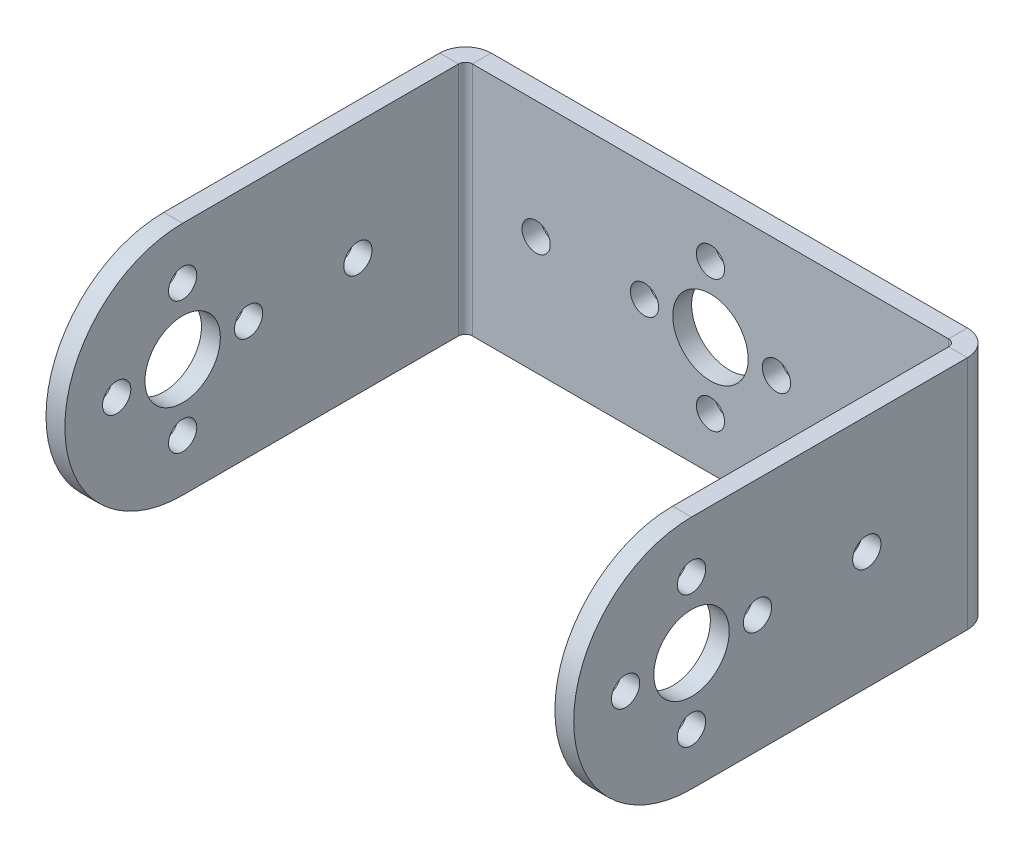
ISO-10303-21;
HEADER;
FILE_DESCRIPTION(('STEP AP214'),'2;1');
FILE_NAME('part.step','',(''),(''),'','','');
FILE_SCHEMA(('AUTOMOTIVE_DESIGN { 1 0 10303 214 1 1 1 1 }'));
ENDSEC;
DATA;
#1=APPLICATION_CONTEXT('core data for automotive mechanical design processes');
#2=APPLICATION_PROTOCOL_DEFINITION('international standard','automotive_design',2000,#1);
#3=PRODUCT_CONTEXT('',#1,'mechanical');
#4=PRODUCT('Part','Part','',(#3));
#5=PRODUCT_RELATED_PRODUCT_CATEGORY('part','',(#4));
#6=PRODUCT_DEFINITION_FORMATION('','',#4);
#7=PRODUCT_DEFINITION_CONTEXT('part definition',#1,'design');
#8=PRODUCT_DEFINITION('design','',#6,#7);
#9=PRODUCT_DEFINITION_SHAPE('','',#8);
#10=(LENGTH_UNIT() NAMED_UNIT(*) SI_UNIT(.MILLI.,.METRE.));
#11=(NAMED_UNIT(*) PLANE_ANGLE_UNIT() SI_UNIT($,.RADIAN.));
#12=(NAMED_UNIT(*) SI_UNIT($,.STERADIAN.) SOLID_ANGLE_UNIT());
#13=UNCERTAINTY_MEASURE_WITH_UNIT(LENGTH_MEASURE(1.E-05),#10,'distance_accuracy_value','');
#14=(GEOMETRIC_REPRESENTATION_CONTEXT(3) GLOBAL_UNCERTAINTY_ASSIGNED_CONTEXT((#13)) GLOBAL_UNIT_ASSIGNED_CONTEXT((#10,
#11,#12)) REPRESENTATION_CONTEXT('',''));
#15=CARTESIAN_POINT('',(0.,0.,0.));
#16=DIRECTION('',(0.,0.,1.));
#17=DIRECTION('',(1.,0.,0.));
#18=AXIS2_PLACEMENT_3D('',#15,#16,#17);
#19=CARTESIAN_POINT('',(-0.999999999999997,-25.,0.));
#20=DIRECTION('',(0.,-1.,0.));
#21=DIRECTION('',(1.,0.,0.));
#22=AXIS2_PLACEMENT_3D('',#19,#20,#21);
#23=PLANE('',#22);
#24=DIRECTION('',(0.,0.,1.));
#25=VECTOR('',#24,1.);
#26=CARTESIAN_POINT('',(1.,-25.,0.));
#27=LINE('',#26,#25);
#28=CARTESIAN_POINT('',(0.999999999999898,-25.,30.0096705338575));
#29=VERTEX_POINT('',#28);
#30=CARTESIAN_POINT('',(1.,-25.,0.736599999999999));
#31=VERTEX_POINT('',#30);
#32=EDGE_CURVE('E201',#29,#31,#27,.F.);
#33=ORIENTED_EDGE('',*,*,#32,.F.);
#34=DIRECTION('',(1.,0.,0.));
#35=VECTOR('',#34,1.);
#36=CARTESIAN_POINT('',(0.999999999999898,-25.,30.0096705338573));
#37=LINE('',#36,#35);
#38=CARTESIAN_POINT('',(-1.0000000000001,-25.,30.0096705338573));
#39=VERTEX_POINT('',#38);
#40=EDGE_CURVE('E105',#29,#39,#37,.F.);
#41=ORIENTED_EDGE('',*,*,#40,.T.);
#42=DIRECTION('',(0.,0.,-1.));
#43=VECTOR('',#42,1.);
#44=CARTESIAN_POINT('',(-0.999999999999997,-25.,0.));
#45=LINE('',#44,#43);
#46=CARTESIAN_POINT('',(-1.,-25.,0.736599999999991));
#47=VERTEX_POINT('',#46);
#48=EDGE_CURVE('E194',#39,#47,#45,.T.);
#49=ORIENTED_EDGE('',*,*,#48,.T.);
#50=DIRECTION('',(-1.,0.,0.));
#51=VECTOR('',#50,1.);
#52=CARTESIAN_POINT('',(1.,-25.,0.736599999999998));
#53=LINE('',#52,#51);
#54=EDGE_CURVE('E218',#31,#47,#53,.T.);
#55=ORIENTED_EDGE('',*,*,#54,.F.);
#56=EDGE_LOOP('',(#33,#41,#49,#55));
#57=FACE_BOUND('',#56,.T.);
#58=ADVANCED_FACE('F87',(#57),#23,.T.);
#59=CARTESIAN_POINT('',(-1.,0.,0.));
#60=DIRECTION('',(-1.,0.,0.));
#61=DIRECTION('',(0.,0.,1.));
#62=AXIS2_PLACEMENT_3D('',#59,#60,#61);
#63=PLANE('',#62);
#64=CARTESIAN_POINT('',(-1.00000000000021,-12.5,11.4096705338575));
#65=DIRECTION('',(1.,0.,0.));
#66=DIRECTION('',(0.,0.,-1.));
#67=AXIS2_PLACEMENT_3D('',#64,#65,#66);
#68=CIRCLE('',#67,1.5);
#69=CARTESIAN_POINT('',(-1.00000000000021,-12.5,9.90967053385751));
#70=VERTEX_POINT('',#69);
#71=EDGE_CURVE('E1006',#70,#70,#68,.T.);
#72=ORIENTED_EDGE('',*,*,#71,.T.);
#73=EDGE_LOOP('',(#72));
#74=FACE_BOUND('',#73,.T.);
#75=CARTESIAN_POINT('',(-1.00000000000017,-12.5,23.0096705338575));
#76=DIRECTION('',(1.,0.,0.));
#77=DIRECTION('',(0.,0.,-1.));
#78=AXIS2_PLACEMENT_3D('',#75,#76,#77);
#79=CIRCLE('',#78,1.5);
#80=CARTESIAN_POINT('',(-1.00000000000018,-12.5,21.5096705338575));
#81=VERTEX_POINT('',#80);
#82=EDGE_CURVE('E352',#81,#81,#79,.T.);
#83=ORIENTED_EDGE('',*,*,#82,.T.);
#84=EDGE_LOOP('',(#83));
#85=FACE_BOUND('',#84,.T.);
#86=CARTESIAN_POINT('',(-1.00000000000015,-5.5,30.0096705338575));
#87=DIRECTION('',(1.,0.,0.));
#88=DIRECTION('',(0.,0.,-1.));
#89=AXIS2_PLACEMENT_3D('',#86,#87,#88);
#90=CIRCLE('',#89,1.5);
#91=CARTESIAN_POINT('',(-1.00000000000015,-5.5,28.5096705338575));
#92=VERTEX_POINT('',#91);
#93=EDGE_CURVE('E347',#92,#92,#90,.T.);
#94=ORIENTED_EDGE('',*,*,#93,.T.);
#95=EDGE_LOOP('',(#94));
#96=FACE_BOUND('',#95,.T.);
#97=CARTESIAN_POINT('',(-1.00000000000013,-12.5,37.0096705338575));
#98=DIRECTION('',(1.,0.,0.));
#99=DIRECTION('',(0.,0.,-1.));
#100=AXIS2_PLACEMENT_3D('',#97,#98,#99);
#101=CIRCLE('',#100,1.5);
#102=CARTESIAN_POINT('',(-1.00000000000013,-12.5,35.5096705338575));
#103=VERTEX_POINT('',#102);
#104=EDGE_CURVE('E342',#103,#103,#101,.T.);
#105=ORIENTED_EDGE('',*,*,#104,.T.);
#106=EDGE_LOOP('',(#105));
#107=FACE_BOUND('',#106,.T.);
#108=CARTESIAN_POINT('',(-1.00000000000015,-19.5,30.0096705338575));
#109=DIRECTION('',(1.,0.,0.));
#110=DIRECTION('',(0.,0.,-1.));
#111=AXIS2_PLACEMENT_3D('',#108,#109,#110);
#112=CIRCLE('',#111,1.5);
#113=CARTESIAN_POINT('',(-1.00000000000015,-19.5,28.5096705338575));
#114=VERTEX_POINT('',#113);
#115=EDGE_CURVE('E336',#114,#114,#112,.T.);
#116=ORIENTED_EDGE('',*,*,#115,.T.);
#117=EDGE_LOOP('',(#116));
#118=FACE_BOUND('',#117,.T.);
#119=CARTESIAN_POINT('',(-1.00000000000015,-12.5,30.0096705338575));
#120=DIRECTION('',(1.,0.,0.));
#121=DIRECTION('',(0.,0.,-1.));
#122=AXIS2_PLACEMENT_3D('',#119,#120,#121);
#123=CIRCLE('',#122,4.);
#124=CARTESIAN_POINT('',(-1.00000000000016,-12.5,26.0096705338575));
#125=VERTEX_POINT('',#124);
#126=EDGE_CURVE('E330',#125,#125,#123,.T.);
#127=ORIENTED_EDGE('',*,*,#126,.T.);
#128=EDGE_LOOP('',(#127));
#129=FACE_BOUND('',#128,.T.);
#130=ORIENTED_EDGE('',*,*,#48,.F.);
#131=CARTESIAN_POINT('',(-1.0000000000001,-12.5,30.0096705338575));
#132=DIRECTION('',(-1.,0.,0.));
#133=DIRECTION('',(0.,0.,1.));
#134=AXIS2_PLACEMENT_3D('',#131,#132,#133);
#135=CIRCLE('',#134,12.5);
#136=CARTESIAN_POINT('',(-1.0000000000001,0.,30.0096705338575));
#137=VERTEX_POINT('',#136);
#138=EDGE_CURVE('E179',#39,#137,#135,.T.);
#139=ORIENTED_EDGE('',*,*,#138,.T.);
#140=DIRECTION('',(0.,0.,1.));
#141=VECTOR('',#140,1.);
#142=CARTESIAN_POINT('',(-1.00000000000016,0.,44.5));
#143=LINE('',#142,#141);
#144=CARTESIAN_POINT('',(-1.,0.,0.73659999999999));
#145=VERTEX_POINT('',#144);
#146=EDGE_CURVE('E193',#145,#137,#143,.T.);
#147=ORIENTED_EDGE('',*,*,#146,.F.);
#148=DIRECTION('',(0.,-1.,0.));
#149=VECTOR('',#148,1.);
#150=CARTESIAN_POINT('',(-1.,0.,0.73659999999999));
#151=LINE('',#150,#149);
#152=EDGE_CURVE('E215',#145,#47,#151,.T.);
#153=ORIENTED_EDGE('',*,*,#152,.T.);
#154=EDGE_LOOP('',(#130,#139,#147,#153));
#155=FACE_BOUND('',#154,.T.);
#156=ADVANCED_FACE('F191',(#74,#85,#96,#107,#118,#129,#155),#63,.T.);
#157=CARTESIAN_POINT('',(1.,0.,0.));
#158=DIRECTION('',(-1.,0.,0.));
#159=DIRECTION('',(0.,0.,1.));
#160=AXIS2_PLACEMENT_3D('',#157,#158,#159);
#161=PLANE('',#160);
#162=CARTESIAN_POINT('',(0.999999999999962,-12.5,11.4096705338575));
#163=DIRECTION('',(-1.,0.,0.));
#164=DIRECTION('',(0.,0.,1.));
#165=AXIS2_PLACEMENT_3D('',#162,#163,#164);
#166=CIRCLE('',#165,1.5);
#167=CARTESIAN_POINT('',(0.999999999999957,-12.5,12.9096705338575));
#168=VERTEX_POINT('',#167);
#169=EDGE_CURVE('E369',#168,#168,#166,.T.);
#170=ORIENTED_EDGE('',*,*,#169,.T.);
#171=EDGE_LOOP('',(#170));
#172=FACE_BOUND('',#171,.T.);
#173=CARTESIAN_POINT('',(0.999999999999922,-12.5,23.0096705338575));
#174=DIRECTION('',(-1.,0.,0.));
#175=DIRECTION('',(0.,0.,1.));
#176=AXIS2_PLACEMENT_3D('',#173,#174,#175);
#177=CIRCLE('',#176,1.5);
#178=CARTESIAN_POINT('',(0.999999999999916,-12.5,24.5096705338575));
#179=VERTEX_POINT('',#178);
#180=EDGE_CURVE('E351',#179,#179,#177,.T.);
#181=ORIENTED_EDGE('',*,*,#180,.T.);
#182=EDGE_LOOP('',(#181));
#183=FACE_BOUND('',#182,.T.);
#184=CARTESIAN_POINT('',(0.999999999999896,-5.5,30.0096705338575));
#185=DIRECTION('',(-1.,0.,0.));
#186=DIRECTION('',(0.,0.,1.));
#187=AXIS2_PLACEMENT_3D('',#184,#185,#186);
#188=CIRCLE('',#187,1.5);
#189=CARTESIAN_POINT('',(0.999999999999891,-5.5,31.5096705338575));
#190=VERTEX_POINT('',#189);
#191=EDGE_CURVE('E346',#190,#190,#188,.T.);
#192=ORIENTED_EDGE('',*,*,#191,.T.);
#193=EDGE_LOOP('',(#192));
#194=FACE_BOUND('',#193,.T.);
#195=CARTESIAN_POINT('',(0.999999999999873,-12.5,37.0096705338575));
#196=DIRECTION('',(-1.,0.,0.));
#197=DIRECTION('',(0.,0.,1.));
#198=AXIS2_PLACEMENT_3D('',#195,#196,#197);
#199=CIRCLE('',#198,1.5);
#200=CARTESIAN_POINT('',(0.999999999999867,-12.5,38.5096705338575));
#201=VERTEX_POINT('',#200);
#202=EDGE_CURVE('E341',#201,#201,#199,.T.);
#203=ORIENTED_EDGE('',*,*,#202,.T.);
#204=EDGE_LOOP('',(#203));
#205=FACE_BOUND('',#204,.T.);
#206=CARTESIAN_POINT('',(0.999999999999898,-19.5,30.0096705338575));
#207=DIRECTION('',(-1.,0.,0.));
#208=DIRECTION('',(0.,0.,1.));
#209=AXIS2_PLACEMENT_3D('',#206,#207,#208);
#210=CIRCLE('',#209,1.5);
#211=CARTESIAN_POINT('',(0.999999999999892,-19.5,31.5096705338575));
#212=VERTEX_POINT('',#211);
#213=EDGE_CURVE('E335',#212,#212,#210,.T.);
#214=ORIENTED_EDGE('',*,*,#213,.T.);
#215=EDGE_LOOP('',(#214));
#216=FACE_BOUND('',#215,.T.);
#217=CARTESIAN_POINT('',(0.999999999999897,-12.5,30.0096705338575));
#218=DIRECTION('',(-1.,0.,0.));
#219=DIRECTION('',(0.,0.,1.));
#220=AXIS2_PLACEMENT_3D('',#217,#218,#219);
#221=CIRCLE('',#220,4.);
#222=CARTESIAN_POINT('',(0.999999999999883,-12.5,34.0096705338575));
#223=VERTEX_POINT('',#222);
#224=EDGE_CURVE('E329',#223,#223,#221,.T.);
#225=ORIENTED_EDGE('',*,*,#224,.T.);
#226=EDGE_LOOP('',(#225));
#227=FACE_BOUND('',#226,.T.);
#228=CARTESIAN_POINT('',(0.999999999999897,-12.5,30.0096705338575));
#229=DIRECTION('',(-1.,0.,0.));
#230=DIRECTION('',(0.,0.,1.));
#231=AXIS2_PLACEMENT_3D('',#228,#229,#230);
#232=CIRCLE('',#231,12.5);
#233=CARTESIAN_POINT('',(0.999999999999895,0.,30.0096705338575));
#234=VERTEX_POINT('',#233);
#235=EDGE_CURVE('E180',#29,#234,#232,.T.);
#236=ORIENTED_EDGE('',*,*,#235,.F.);
#237=ORIENTED_EDGE('',*,*,#32,.T.);
#238=DIRECTION('',(0.,1.,0.));
#239=VECTOR('',#238,1.);
#240=CARTESIAN_POINT('',(0.999999999999997,0.,0.736599999999997));
#241=LINE('',#240,#239);
#242=CARTESIAN_POINT('',(0.999999999999997,0.,0.736599999999997));
#243=VERTEX_POINT('',#242);
#244=EDGE_CURVE('E222',#243,#31,#241,.F.);
#245=ORIENTED_EDGE('',*,*,#244,.F.);
#246=DIRECTION('',(0.,0.,-1.));
#247=VECTOR('',#246,1.);
#248=CARTESIAN_POINT('',(1.,0.,0.));
#249=LINE('',#248,#247);
#250=EDGE_CURVE('E209',#243,#234,#249,.F.);
#251=ORIENTED_EDGE('',*,*,#250,.T.);
#252=EDGE_LOOP('',(#236,#237,#245,#251));
#253=FACE_BOUND('',#252,.T.);
#254=ADVANCED_FACE('F534',(#172,#183,#194,#205,#216,#227,#253),#161,.F.);
#255=CARTESIAN_POINT('',(55.,-25.,0.));
#256=DIRECTION('',(0.,-1.,0.));
#257=DIRECTION('',(0.,0.,-1.));
#258=AXIS2_PLACEMENT_3D('',#255,#256,#257);
#259=PLANE('',#258);
#260=DIRECTION('',(0.,0.,-1.));
#261=VECTOR('',#260,1.);
#262=CARTESIAN_POINT('',(55.,-25.,0.));
#263=LINE('',#262,#261);
#264=CARTESIAN_POINT('',(55.,-25.,0.73659999999999));
#265=VERTEX_POINT('',#264);
#266=CARTESIAN_POINT('',(55.0000000000001,-25.,30.0096705338573));
#267=VERTEX_POINT('',#266);
#268=EDGE_CURVE('E432',#265,#267,#263,.F.);
#269=ORIENTED_EDGE('',*,*,#268,.T.);
#270=DIRECTION('',(-1.,0.,0.));
#271=VECTOR('',#270,1.);
#272=CARTESIAN_POINT('',(53.0000000000001,-25.,30.0096705338573));
#273=LINE('',#272,#271);
#274=CARTESIAN_POINT('',(53.0000000000001,-25.,30.0096705338573));
#275=VERTEX_POINT('',#274);
#276=EDGE_CURVE('E420',#275,#267,#273,.F.);
#277=ORIENTED_EDGE('',*,*,#276,.F.);
#278=DIRECTION('',(0.,0.,1.));
#279=VECTOR('',#278,1.);
#280=CARTESIAN_POINT('',(53.,-25.,-1.8524507770431E-13));
#281=LINE('',#280,#279);
#282=CARTESIAN_POINT('',(53.,-25.,0.736599999999997));
#283=VERTEX_POINT('',#282);
#284=EDGE_CURVE('E439',#283,#275,#281,.T.);
#285=ORIENTED_EDGE('',*,*,#284,.F.);
#286=DIRECTION('',(1.,0.,0.));
#287=VECTOR('',#286,1.);
#288=CARTESIAN_POINT('',(55.,-25.,0.73659999999999));
#289=LINE('',#288,#287);
#290=EDGE_CURVE('E425',#283,#265,#289,.T.);
#291=ORIENTED_EDGE('',*,*,#290,.T.);
#292=EDGE_LOOP('',(#269,#277,#285,#291));
#293=FACE_BOUND('',#292,.T.);
#294=ADVANCED_FACE('F511',(#293),#259,.T.);
#295=CARTESIAN_POINT('',(55.,0.,-1.92228040381996E-13));
#296=DIRECTION('',(-1.,0.,0.));
#297=DIRECTION('',(0.,0.,1.));
#298=AXIS2_PLACEMENT_3D('',#295,#296,#297);
#299=PLANE('',#298);
#300=CARTESIAN_POINT('',(55.,-12.5,11.4096705338573));
#301=DIRECTION('',(1.,0.,0.));
#302=DIRECTION('',(0.,0.,-1.));
#303=AXIS2_PLACEMENT_3D('',#300,#301,#302);
#304=CIRCLE('',#303,1.5);
#305=CARTESIAN_POINT('',(55.,-12.5,9.90967053385731));
#306=VERTEX_POINT('',#305);
#307=EDGE_CURVE('E1009',#306,#306,#304,.T.);
#308=ORIENTED_EDGE('',*,*,#307,.F.);
#309=EDGE_LOOP('',(#308));
#310=FACE_BOUND('',#309,.T.);
#311=CARTESIAN_POINT('',(55.0000000000001,-12.5,23.0096705338573));
#312=DIRECTION('',(1.,0.,0.));
#313=DIRECTION('',(0.,0.,-1.));
#314=AXIS2_PLACEMENT_3D('',#311,#312,#313);
#315=CIRCLE('',#314,1.5);
#316=CARTESIAN_POINT('',(55.0000000000001,-12.5,21.5096705338573));
#317=VERTEX_POINT('',#316);
#318=EDGE_CURVE('E362',#317,#317,#315,.T.);
#319=ORIENTED_EDGE('',*,*,#318,.F.);
#320=EDGE_LOOP('',(#319));
#321=FACE_BOUND('',#320,.T.);
#322=CARTESIAN_POINT('',(55.0000000000001,-5.5,30.0096705338573));
#323=DIRECTION('',(1.,0.,0.));
#324=DIRECTION('',(0.,0.,-1.));
#325=AXIS2_PLACEMENT_3D('',#322,#323,#324);
#326=CIRCLE('',#325,1.5);
#327=CARTESIAN_POINT('',(55.0000000000001,-5.5,28.5096705338573));
#328=VERTEX_POINT('',#327);
#329=EDGE_CURVE('E358',#328,#328,#326,.T.);
#330=ORIENTED_EDGE('',*,*,#329,.F.);
#331=EDGE_LOOP('',(#330));
#332=FACE_BOUND('',#331,.T.);
#333=CARTESIAN_POINT('',(55.0000000000001,-12.5,37.0096705338573));
#334=DIRECTION('',(1.,0.,0.));
#335=DIRECTION('',(0.,0.,-1.));
#336=AXIS2_PLACEMENT_3D('',#333,#334,#335);
#337=CIRCLE('',#336,1.5);
#338=CARTESIAN_POINT('',(55.0000000000001,-12.5,35.5096705338573));
#339=VERTEX_POINT('',#338);
#340=EDGE_CURVE('E383',#339,#339,#337,.T.);
#341=ORIENTED_EDGE('',*,*,#340,.F.);
#342=EDGE_LOOP('',(#341));
#343=FACE_BOUND('',#342,.T.);
#344=CARTESIAN_POINT('',(55.0000000000001,-19.5,30.0096705338573));
#345=DIRECTION('',(1.,0.,0.));
#346=DIRECTION('',(0.,0.,-1.));
#347=AXIS2_PLACEMENT_3D('',#344,#345,#346);
#348=CIRCLE('',#347,1.5);
#349=CARTESIAN_POINT('',(55.0000000000001,-19.5,28.5096705338573));
#350=VERTEX_POINT('',#349);
#351=EDGE_CURVE('E393',#350,#350,#348,.T.);
#352=ORIENTED_EDGE('',*,*,#351,.F.);
#353=EDGE_LOOP('',(#352));
#354=FACE_BOUND('',#353,.T.);
#355=CARTESIAN_POINT('',(55.0000000000001,-12.5,30.0096705338573));
#356=DIRECTION('',(1.,0.,0.));
#357=DIRECTION('',(0.,0.,-1.));
#358=AXIS2_PLACEMENT_3D('',#355,#356,#357);
#359=CIRCLE('',#358,4.);
#360=CARTESIAN_POINT('',(55.0000000000001,-12.5,26.0096705338573));
#361=VERTEX_POINT('',#360);
#362=EDGE_CURVE('E403',#361,#361,#359,.T.);
#363=ORIENTED_EDGE('',*,*,#362,.F.);
#364=EDGE_LOOP('',(#363));
#365=FACE_BOUND('',#364,.T.);
#366=CARTESIAN_POINT('',(55.0000000000001,-12.5,30.0096705338573));
#367=DIRECTION('',(-1.,0.,0.));
#368=DIRECTION('',(0.,0.,1.));
#369=AXIS2_PLACEMENT_3D('',#366,#367,#368);
#370=CIRCLE('',#369,12.5);
#371=CARTESIAN_POINT('',(55.0000000000001,0.,30.0096705338573));
#372=VERTEX_POINT('',#371);
#373=EDGE_CURVE('E417',#267,#372,#370,.T.);
#374=ORIENTED_EDGE('',*,*,#373,.F.);
#375=ORIENTED_EDGE('',*,*,#268,.F.);
#376=DIRECTION('',(0.,1.,0.));
#377=VECTOR('',#376,1.);
#378=CARTESIAN_POINT('',(55.,-25.,0.73659999999999));
#379=LINE('',#378,#377);
#380=CARTESIAN_POINT('',(55.,0.,0.73659999999999));
#381=VERTEX_POINT('',#380);
#382=EDGE_CURVE('E443',#381,#265,#379,.F.);
#383=ORIENTED_EDGE('',*,*,#382,.F.);
#384=DIRECTION('',(0.,0.,1.));
#385=VECTOR('',#384,1.);
#386=CARTESIAN_POINT('',(55.0000000000002,0.,44.5));
#387=LINE('',#386,#385);
#388=EDGE_CURVE('E428',#372,#381,#387,.F.);
#389=ORIENTED_EDGE('',*,*,#388,.F.);
#390=EDGE_LOOP('',(#374,#375,#383,#389));
#391=FACE_BOUND('',#390,.T.);
#392=ADVANCED_FACE('F505',(#310,#321,#332,#343,#354,#365,#391),#299,.F.);
#393=CARTESIAN_POINT('',(53.,0.,-1.8524507770431E-13));
#394=DIRECTION('',(-1.,0.,0.));
#395=DIRECTION('',(0.,0.,1.));
#396=AXIS2_PLACEMENT_3D('',#393,#394,#395);
#397=PLANE('',#396);
#398=CARTESIAN_POINT('',(53.,-12.5,11.4096705338573));
#399=DIRECTION('',(-1.,0.,0.));
#400=DIRECTION('',(0.,0.,1.));
#401=AXIS2_PLACEMENT_3D('',#398,#399,#400);
#402=CIRCLE('',#401,1.5);
#403=CARTESIAN_POINT('',(53.,-12.5,12.9096705338573));
#404=VERTEX_POINT('',#403);
#405=EDGE_CURVE('E91',#404,#404,#402,.T.);
#406=ORIENTED_EDGE('',*,*,#405,.F.);
#407=EDGE_LOOP('',(#406));
#408=FACE_BOUND('',#407,.T.);
#409=CARTESIAN_POINT('',(53.0000000000001,-12.5,23.0096705338573));
#410=DIRECTION('',(-1.,0.,0.));
#411=DIRECTION('',(0.,0.,1.));
#412=AXIS2_PLACEMENT_3D('',#409,#410,#411);
#413=CIRCLE('',#412,1.5);
#414=CARTESIAN_POINT('',(53.0000000000001,-12.5,24.5096705338573));
#415=VERTEX_POINT('',#414);
#416=EDGE_CURVE('E348',#415,#415,#413,.T.);
#417=ORIENTED_EDGE('',*,*,#416,.F.);
#418=EDGE_LOOP('',(#417));
#419=FACE_BOUND('',#418,.T.);
#420=CARTESIAN_POINT('',(53.0000000000001,-5.5,30.0096705338573));
#421=DIRECTION('',(-1.,0.,0.));
#422=DIRECTION('',(0.,0.,1.));
#423=AXIS2_PLACEMENT_3D('',#420,#421,#422);
#424=CIRCLE('',#423,1.5);
#425=CARTESIAN_POINT('',(53.0000000000001,-5.5,31.5096705338573));
#426=VERTEX_POINT('',#425);
#427=EDGE_CURVE('E343',#426,#426,#424,.T.);
#428=ORIENTED_EDGE('',*,*,#427,.F.);
#429=EDGE_LOOP('',(#428));
#430=FACE_BOUND('',#429,.T.);
#431=CARTESIAN_POINT('',(53.0000000000001,-12.5,37.0096705338573));
#432=DIRECTION('',(-1.,0.,0.));
#433=DIRECTION('',(0.,0.,1.));
#434=AXIS2_PLACEMENT_3D('',#431,#432,#433);
#435=CIRCLE('',#434,1.5);
#436=CARTESIAN_POINT('',(53.0000000000001,-12.5,38.5096705338573));
#437=VERTEX_POINT('',#436);
#438=EDGE_CURVE('E337',#437,#437,#435,.T.);
#439=ORIENTED_EDGE('',*,*,#438,.F.);
#440=EDGE_LOOP('',(#439));
#441=FACE_BOUND('',#440,.T.);
#442=CARTESIAN_POINT('',(53.0000000000001,-19.5,30.0096705338573));
#443=DIRECTION('',(-1.,0.,0.));
#444=DIRECTION('',(0.,0.,1.));
#445=AXIS2_PLACEMENT_3D('',#442,#443,#444);
#446=CIRCLE('',#445,1.5);
#447=CARTESIAN_POINT('',(53.0000000000001,-19.5,31.5096705338573));
#448=VERTEX_POINT('',#447);
#449=EDGE_CURVE('E331',#448,#448,#446,.T.);
#450=ORIENTED_EDGE('',*,*,#449,.F.);
#451=EDGE_LOOP('',(#450));
#452=FACE_BOUND('',#451,.T.);
#453=CARTESIAN_POINT('',(53.0000000000001,-12.5,30.0096705338573));
#454=DIRECTION('',(-1.,0.,0.));
#455=DIRECTION('',(0.,0.,1.));
#456=AXIS2_PLACEMENT_3D('',#453,#454,#455);
#457=CIRCLE('',#456,4.);
#458=CARTESIAN_POINT('',(53.0000000000001,-12.5,34.0096705338573));
#459=VERTEX_POINT('',#458);
#460=EDGE_CURVE('E325',#459,#459,#457,.T.);
#461=ORIENTED_EDGE('',*,*,#460,.F.);
#462=EDGE_LOOP('',(#461));
#463=FACE_BOUND('',#462,.T.);
#464=ORIENTED_EDGE('',*,*,#284,.T.);
#465=CARTESIAN_POINT('',(53.0000000000001,-12.5,30.0096705338573));
#466=DIRECTION('',(-1.,0.,0.));
#467=DIRECTION('',(0.,0.,1.));
#468=AXIS2_PLACEMENT_3D('',#465,#466,#467);
#469=CIRCLE('',#468,12.5);
#470=CARTESIAN_POINT('',(53.0000000000001,0.,30.0096705338573));
#471=VERTEX_POINT('',#470);
#472=EDGE_CURVE('E186',#275,#471,#469,.T.);
#473=ORIENTED_EDGE('',*,*,#472,.T.);
#474=DIRECTION('',(0.,0.,-1.));
#475=VECTOR('',#474,1.);
#476=CARTESIAN_POINT('',(53.,0.,-1.8524507770431E-13));
#477=LINE('',#476,#475);
#478=CARTESIAN_POINT('',(53.,0.,0.736599999999997));
#479=VERTEX_POINT('',#478);
#480=EDGE_CURVE('E436',#471,#479,#477,.T.);
#481=ORIENTED_EDGE('',*,*,#480,.T.);
#482=DIRECTION('',(0.,1.,0.));
#483=VECTOR('',#482,1.);
#484=CARTESIAN_POINT('',(53.,-25.,0.736599999999997));
#485=LINE('',#484,#483);
#486=EDGE_CURVE('E450',#283,#479,#485,.T.);
#487=ORIENTED_EDGE('',*,*,#486,.F.);
#488=EDGE_LOOP('',(#464,#473,#481,#487));
#489=FACE_BOUND('',#488,.T.);
#490=ADVANCED_FACE('F515',(#408,#419,#430,#441,#452,#463,#489),#397,.T.);
#491=CARTESIAN_POINT('',(0.,0.,-2.));
#492=DIRECTION('',(0.,0.,1.));
#493=DIRECTION('',(1.,0.,0.));
#494=AXIS2_PLACEMENT_3D('',#491,#492,#493);
#495=PLANE('',#494);
#496=CARTESIAN_POINT('',(8.5,-12.5,-2.));
#497=DIRECTION('',(0.,0.,1.));
#498=DIRECTION('',(1.,0.,0.));
#499=AXIS2_PLACEMENT_3D('',#496,#497,#498);
#500=CIRCLE('',#499,1.5);
#501=CARTESIAN_POINT('',(10.,-12.5,-2.));
#502=VERTEX_POINT('',#501);
#503=EDGE_CURVE('E261',#502,#502,#500,.T.);
#504=ORIENTED_EDGE('',*,*,#503,.T.);
#505=EDGE_LOOP('',(#504));
#506=FACE_BOUND('',#505,.T.);
#507=CARTESIAN_POINT('',(45.5,-12.5,-2.));
#508=DIRECTION('',(0.,0.,1.));
#509=DIRECTION('',(1.,0.,0.));
#510=AXIS2_PLACEMENT_3D('',#507,#508,#509);
#511=CIRCLE('',#510,1.5);
#512=CARTESIAN_POINT('',(47.,-12.5,-2.));
#513=VERTEX_POINT('',#512);
#514=EDGE_CURVE('E269',#513,#513,#511,.T.);
#515=ORIENTED_EDGE('',*,*,#514,.T.);
#516=EDGE_LOOP('',(#515));
#517=FACE_BOUND('',#516,.T.);
#518=CARTESIAN_POINT('',(20.,-12.5,-2.));
#519=DIRECTION('',(0.,0.,1.));
#520=DIRECTION('',(1.,0.,0.));
#521=AXIS2_PLACEMENT_3D('',#518,#519,#520);
#522=CIRCLE('',#521,1.5);
#523=CARTESIAN_POINT('',(21.5,-12.5,-2.));
#524=VERTEX_POINT('',#523);
#525=EDGE_CURVE('E277',#524,#524,#522,.T.);
#526=ORIENTED_EDGE('',*,*,#525,.T.);
#527=EDGE_LOOP('',(#526));
#528=FACE_BOUND('',#527,.T.);
#529=CARTESIAN_POINT('',(34.,-12.5,-2.));
#530=DIRECTION('',(0.,0.,1.));
#531=DIRECTION('',(1.,0.,0.));
#532=AXIS2_PLACEMENT_3D('',#529,#530,#531);
#533=CIRCLE('',#532,1.5);
#534=CARTESIAN_POINT('',(35.5,-12.5,-2.));
#535=VERTEX_POINT('',#534);
#536=EDGE_CURVE('E285',#535,#535,#533,.T.);
#537=ORIENTED_EDGE('',*,*,#536,.T.);
#538=EDGE_LOOP('',(#537));
#539=FACE_BOUND('',#538,.T.);
#540=CARTESIAN_POINT('',(27.,-19.5,-2.));
#541=DIRECTION('',(0.,0.,1.));
#542=DIRECTION('',(1.,0.,0.));
#543=AXIS2_PLACEMENT_3D('',#540,#541,#542);
#544=CIRCLE('',#543,1.5);
#545=CARTESIAN_POINT('',(28.5,-19.5,-2.));
#546=VERTEX_POINT('',#545);
#547=EDGE_CURVE('E293',#546,#546,#544,.T.);
#548=ORIENTED_EDGE('',*,*,#547,.T.);
#549=EDGE_LOOP('',(#548));
#550=FACE_BOUND('',#549,.T.);
#551=CARTESIAN_POINT('',(27.,-5.5,-2.));
#552=DIRECTION('',(0.,0.,1.));
#553=DIRECTION('',(1.,0.,0.));
#554=AXIS2_PLACEMENT_3D('',#551,#552,#553);
#555=CIRCLE('',#554,1.5);
#556=CARTESIAN_POINT('',(28.5,-5.5,-2.));
#557=VERTEX_POINT('',#556);
#558=EDGE_CURVE('E300',#557,#557,#555,.T.);
#559=ORIENTED_EDGE('',*,*,#558,.T.);
#560=EDGE_LOOP('',(#559));
#561=FACE_BOUND('',#560,.T.);
#562=CARTESIAN_POINT('',(27.,-12.5,-2.));
#563=DIRECTION('',(0.,0.,1.));
#564=DIRECTION('',(1.,0.,0.));
#565=AXIS2_PLACEMENT_3D('',#562,#563,#564);
#566=CIRCLE('',#565,4.);
#567=CARTESIAN_POINT('',(31.,-12.5,-2.));
#568=VERTEX_POINT('',#567);
#569=EDGE_CURVE('E308',#568,#568,#566,.T.);
#570=ORIENTED_EDGE('',*,*,#569,.T.);
#571=EDGE_LOOP('',(#570));
#572=FACE_BOUND('',#571,.T.);
#573=DIRECTION('',(0.,1.,0.));
#574=VECTOR('',#573,1.);
#575=CARTESIAN_POINT('',(52.2634,0.,-2.));
#576=LINE('',#575,#574);
#577=CARTESIAN_POINT('',(52.2634,0.,-2.));
#578=VERTEX_POINT('',#577);
#579=CARTESIAN_POINT('',(52.2634,-25.,-2.));
#580=VERTEX_POINT('',#579);
#581=EDGE_CURVE('E457',#578,#580,#576,.F.);
#582=ORIENTED_EDGE('',*,*,#581,.T.);
#583=DIRECTION('',(1.,0.,0.));
#584=VECTOR('',#583,1.);
#585=CARTESIAN_POINT('',(0.,-25.,-2.));
#586=LINE('',#585,#584);
#587=CARTESIAN_POINT('',(1.73659999999999,-25.,-2.));
#588=VERTEX_POINT('',#587);
#589=EDGE_CURVE('E97',#588,#580,#586,.T.);
#590=ORIENTED_EDGE('',*,*,#589,.F.);
#591=DIRECTION('',(0.,-1.,0.));
#592=VECTOR('',#591,1.);
#593=CARTESIAN_POINT('',(1.73659999999999,-25.,-2.));
#594=LINE('',#593,#592);
#595=CARTESIAN_POINT('',(1.73659999999999,0.,-2.));
#596=VERTEX_POINT('',#595);
#597=EDGE_CURVE('E229',#588,#596,#594,.F.);
#598=ORIENTED_EDGE('',*,*,#597,.T.);
#599=DIRECTION('',(-1.,0.,0.));
#600=VECTOR('',#599,1.);
#601=CARTESIAN_POINT('',(0.,0.,-2.));
#602=LINE('',#601,#600);
#603=EDGE_CURVE('E13',#578,#596,#602,.T.);
#604=ORIENTED_EDGE('',*,*,#603,.F.);
#605=EDGE_LOOP('',(#582,#590,#598,#604));
#606=FACE_BOUND('',#605,.T.);
#607=ADVANCED_FACE('F784',(#506,#517,#528,#539,#550,#561,#572,#606),#495,.F.);
#608=CARTESIAN_POINT('',(0.,0.,0.));
#609=DIRECTION('',(0.,0.,1.));
#610=DIRECTION('',(1.,0.,0.));
#611=AXIS2_PLACEMENT_3D('',#608,#609,#610);
#612=PLANE('',#611);
#613=CARTESIAN_POINT('',(8.5,-12.5,0.));
#614=DIRECTION('',(0.,0.,1.));
#615=DIRECTION('',(1.,0.,0.));
#616=AXIS2_PLACEMENT_3D('',#613,#614,#615);
#617=CIRCLE('',#616,1.5);
#618=CARTESIAN_POINT('',(10.,-12.5,0.));
#619=VERTEX_POINT('',#618);
#620=EDGE_CURVE('E257',#619,#619,#617,.T.);
#621=ORIENTED_EDGE('',*,*,#620,.F.);
#622=EDGE_LOOP('',(#621));
#623=FACE_BOUND('',#622,.T.);
#624=CARTESIAN_POINT('',(45.5,-12.5,0.));
#625=DIRECTION('',(0.,0.,1.));
#626=DIRECTION('',(1.,0.,0.));
#627=AXIS2_PLACEMENT_3D('',#624,#625,#626);
#628=CIRCLE('',#627,1.5);
#629=CARTESIAN_POINT('',(47.,-12.5,0.));
#630=VERTEX_POINT('',#629);
#631=EDGE_CURVE('E265',#630,#630,#628,.T.);
#632=ORIENTED_EDGE('',*,*,#631,.F.);
#633=EDGE_LOOP('',(#632));
#634=FACE_BOUND('',#633,.T.);
#635=CARTESIAN_POINT('',(20.,-12.5,0.));
#636=DIRECTION('',(0.,0.,1.));
#637=DIRECTION('',(1.,0.,0.));
#638=AXIS2_PLACEMENT_3D('',#635,#636,#637);
#639=CIRCLE('',#638,1.5);
#640=CARTESIAN_POINT('',(21.5,-12.5,0.));
#641=VERTEX_POINT('',#640);
#642=EDGE_CURVE('E273',#641,#641,#639,.T.);
#643=ORIENTED_EDGE('',*,*,#642,.F.);
#644=EDGE_LOOP('',(#643));
#645=FACE_BOUND('',#644,.T.);
#646=CARTESIAN_POINT('',(34.,-12.5,0.));
#647=DIRECTION('',(0.,0.,1.));
#648=DIRECTION('',(1.,0.,0.));
#649=AXIS2_PLACEMENT_3D('',#646,#647,#648);
#650=CIRCLE('',#649,1.5);
#651=CARTESIAN_POINT('',(35.5,-12.5,0.));
#652=VERTEX_POINT('',#651);
#653=EDGE_CURVE('E281',#652,#652,#650,.T.);
#654=ORIENTED_EDGE('',*,*,#653,.F.);
#655=EDGE_LOOP('',(#654));
#656=FACE_BOUND('',#655,.T.);
#657=CARTESIAN_POINT('',(27.,-19.5,0.));
#658=DIRECTION('',(0.,0.,1.));
#659=DIRECTION('',(1.,0.,0.));
#660=AXIS2_PLACEMENT_3D('',#657,#658,#659);
#661=CIRCLE('',#660,1.5);
#662=CARTESIAN_POINT('',(28.5,-19.5,0.));
#663=VERTEX_POINT('',#662);
#664=EDGE_CURVE('E289',#663,#663,#661,.T.);
#665=ORIENTED_EDGE('',*,*,#664,.F.);
#666=EDGE_LOOP('',(#665));
#667=FACE_BOUND('',#666,.T.);
#668=CARTESIAN_POINT('',(27.,-5.5,0.));
#669=DIRECTION('',(0.,0.,1.));
#670=DIRECTION('',(1.,0.,0.));
#671=AXIS2_PLACEMENT_3D('',#668,#669,#670);
#672=CIRCLE('',#671,1.5);
#673=CARTESIAN_POINT('',(28.5,-5.5,0.));
#674=VERTEX_POINT('',#673);
#675=EDGE_CURVE('E296',#674,#674,#672,.T.);
#676=ORIENTED_EDGE('',*,*,#675,.F.);
#677=EDGE_LOOP('',(#676));
#678=FACE_BOUND('',#677,.T.);
#679=CARTESIAN_POINT('',(27.,-12.5,0.));
#680=DIRECTION('',(0.,0.,1.));
#681=DIRECTION('',(1.,0.,0.));
#682=AXIS2_PLACEMENT_3D('',#679,#680,#681);
#683=CIRCLE('',#682,4.);
#684=CARTESIAN_POINT('',(31.,-12.5,0.));
#685=VERTEX_POINT('',#684);
#686=EDGE_CURVE('E304',#685,#685,#683,.T.);
#687=ORIENTED_EDGE('',*,*,#686,.F.);
#688=EDGE_LOOP('',(#687));
#689=FACE_BOUND('',#688,.T.);
#690=DIRECTION('',(1.,0.,0.));
#691=VECTOR('',#690,1.);
#692=CARTESIAN_POINT('',(0.,-25.,0.));
#693=LINE('',#692,#691);
#694=CARTESIAN_POINT('',(1.7366,-25.,0.));
#695=VERTEX_POINT('',#694);
#696=CARTESIAN_POINT('',(52.2634,-25.,0.));
#697=VERTEX_POINT('',#696);
#698=EDGE_CURVE('E312',#695,#697,#693,.T.);
#699=ORIENTED_EDGE('',*,*,#698,.T.);
#700=DIRECTION('',(0.,1.,0.));
#701=VECTOR('',#700,1.);
#702=CARTESIAN_POINT('',(52.2634,0.,0.));
#703=LINE('',#702,#701);
#704=CARTESIAN_POINT('',(52.2634,0.,0.));
#705=VERTEX_POINT('',#704);
#706=EDGE_CURVE('E472',#705,#697,#703,.F.);
#707=ORIENTED_EDGE('',*,*,#706,.F.);
#708=DIRECTION('',(-1.,0.,0.));
#709=VECTOR('',#708,1.);
#710=CARTESIAN_POINT('',(0.,0.,0.));
#711=LINE('',#710,#709);
#712=CARTESIAN_POINT('',(1.73659999999999,0.,0.));
#713=VERTEX_POINT('',#712);
#714=EDGE_CURVE('E318',#705,#713,#711,.T.);
#715=ORIENTED_EDGE('',*,*,#714,.T.);
#716=DIRECTION('',(0.,-1.,0.));
#717=VECTOR('',#716,1.);
#718=CARTESIAN_POINT('',(1.7366,-25.,0.));
#719=LINE('',#718,#717);
#720=EDGE_CURVE('E246',#695,#713,#719,.F.);
#721=ORIENTED_EDGE('',*,*,#720,.F.);
#722=EDGE_LOOP('',(#699,#707,#715,#721));
#723=FACE_BOUND('',#722,.T.);
#724=ADVANCED_FACE('F519',(#623,#634,#645,#656,#667,#678,#689,#723),#612,.T.);
#725=CARTESIAN_POINT('',(0.,0.,-2.));
#726=DIRECTION('',(0.,1.,0.));
#727=DIRECTION('',(0.,0.,1.));
#728=AXIS2_PLACEMENT_3D('',#725,#726,#727);
#729=PLANE('',#728);
#730=ORIENTED_EDGE('',*,*,#714,.F.);
#731=DIRECTION('',(0.,0.,-1.));
#732=VECTOR('',#731,1.);
#733=CARTESIAN_POINT('',(52.2634,0.,0.));
#734=LINE('',#733,#732);
#735=EDGE_CURVE('E465',#705,#578,#734,.T.);
#736=ORIENTED_EDGE('',*,*,#735,.T.);
#737=ORIENTED_EDGE('',*,*,#603,.T.);
#738=DIRECTION('',(0.,0.,-1.));
#739=VECTOR('',#738,1.);
#740=CARTESIAN_POINT('',(1.73659999999999,0.,0.));
#741=LINE('',#740,#739);
#742=EDGE_CURVE('E253',#713,#596,#741,.T.);
#743=ORIENTED_EDGE('',*,*,#742,.F.);
#744=EDGE_LOOP('',(#730,#736,#737,#743));
#745=FACE_BOUND('',#744,.T.);
#746=ADVANCED_FACE('F487',(#745),#729,.T.);
#747=CARTESIAN_POINT('',(0.,-25.,-2.));
#748=DIRECTION('',(0.,-1.,0.));
#749=DIRECTION('',(0.,0.,-1.));
#750=AXIS2_PLACEMENT_3D('',#747,#748,#749);
#751=PLANE('',#750);
#752=DIRECTION('',(0.,0.,-1.));
#753=VECTOR('',#752,1.);
#754=CARTESIAN_POINT('',(52.2634,-25.,0.));
#755=LINE('',#754,#753);
#756=EDGE_CURVE('E228',#697,#580,#755,.T.);
#757=ORIENTED_EDGE('',*,*,#756,.F.);
#758=ORIENTED_EDGE('',*,*,#698,.F.);
#759=DIRECTION('',(0.,0.,-1.));
#760=VECTOR('',#759,1.);
#761=CARTESIAN_POINT('',(1.7366,-25.,0.));
#762=LINE('',#761,#760);
#763=EDGE_CURVE('E238',#695,#588,#762,.T.);
#764=ORIENTED_EDGE('',*,*,#763,.T.);
#765=ORIENTED_EDGE('',*,*,#589,.T.);
#766=EDGE_LOOP('',(#757,#758,#764,#765));
#767=FACE_BOUND('',#766,.T.);
#768=ADVANCED_FACE('F89',(#767),#751,.T.);
#769=CARTESIAN_POINT('',(27.,-12.5,-2.));
#770=DIRECTION('',(0.,0.,1.));
#771=DIRECTION('',(1.,0.,0.));
#772=AXIS2_PLACEMENT_3D('',#769,#770,#771);
#773=CYLINDRICAL_SURFACE('',#772,4.);
#774=ORIENTED_EDGE('',*,*,#569,.F.);
#775=EDGE_LOOP('',(#774));
#776=FACE_BOUND('',#775,.T.);
#777=ORIENTED_EDGE('',*,*,#686,.T.);
#778=EDGE_LOOP('',(#777));
#779=FACE_BOUND('',#778,.T.);
#780=ADVANCED_FACE('F870',(#776,#779),#773,.F.);
#781=CARTESIAN_POINT('',(27.,-5.5,-2.));
#782=DIRECTION('',(0.,0.,1.));
#783=DIRECTION('',(1.,0.,0.));
#784=AXIS2_PLACEMENT_3D('',#781,#782,#783);
#785=CYLINDRICAL_SURFACE('',#784,1.5);
#786=ORIENTED_EDGE('',*,*,#558,.F.);
#787=EDGE_LOOP('',(#786));
#788=FACE_BOUND('',#787,.T.);
#789=ORIENTED_EDGE('',*,*,#675,.T.);
#790=EDGE_LOOP('',(#789));
#791=FACE_BOUND('',#790,.T.);
#792=ADVANCED_FACE('F917',(#788,#791),#785,.F.);
#793=CARTESIAN_POINT('',(27.,-19.5,-2.));
#794=DIRECTION('',(0.,0.,1.));
#795=DIRECTION('',(1.,0.,0.));
#796=AXIS2_PLACEMENT_3D('',#793,#794,#795);
#797=CYLINDRICAL_SURFACE('',#796,1.5);
#798=ORIENTED_EDGE('',*,*,#547,.F.);
#799=EDGE_LOOP('',(#798));
#800=FACE_BOUND('',#799,.T.);
#801=ORIENTED_EDGE('',*,*,#664,.T.);
#802=EDGE_LOOP('',(#801));
#803=FACE_BOUND('',#802,.T.);
#804=ADVANCED_FACE('F906',(#800,#803),#797,.F.);
#805=CARTESIAN_POINT('',(34.,-12.5,-2.));
#806=DIRECTION('',(0.,0.,1.));
#807=DIRECTION('',(1.,0.,0.));
#808=AXIS2_PLACEMENT_3D('',#805,#806,#807);
#809=CYLINDRICAL_SURFACE('',#808,1.5);
#810=ORIENTED_EDGE('',*,*,#536,.F.);
#811=EDGE_LOOP('',(#810));
#812=FACE_BOUND('',#811,.T.);
#813=ORIENTED_EDGE('',*,*,#653,.T.);
#814=EDGE_LOOP('',(#813));
#815=FACE_BOUND('',#814,.T.);
#816=ADVANCED_FACE('F895',(#812,#815),#809,.F.);
#817=CARTESIAN_POINT('',(20.,-12.5,-2.));
#818=DIRECTION('',(0.,0.,1.));
#819=DIRECTION('',(1.,0.,0.));
#820=AXIS2_PLACEMENT_3D('',#817,#818,#819);
#821=CYLINDRICAL_SURFACE('',#820,1.5);
#822=ORIENTED_EDGE('',*,*,#525,.F.);
#823=EDGE_LOOP('',(#822));
#824=FACE_BOUND('',#823,.T.);
#825=ORIENTED_EDGE('',*,*,#642,.T.);
#826=EDGE_LOOP('',(#825));
#827=FACE_BOUND('',#826,.T.);
#828=ADVANCED_FACE('F884',(#824,#827),#821,.F.);
#829=CARTESIAN_POINT('',(45.5,-12.5,-2.));
#830=DIRECTION('',(0.,0.,1.));
#831=DIRECTION('',(1.,0.,0.));
#832=AXIS2_PLACEMENT_3D('',#829,#830,#831);
#833=CYLINDRICAL_SURFACE('',#832,1.5);
#834=ORIENTED_EDGE('',*,*,#514,.F.);
#835=EDGE_LOOP('',(#834));
#836=FACE_BOUND('',#835,.T.);
#837=ORIENTED_EDGE('',*,*,#631,.T.);
#838=EDGE_LOOP('',(#837));
#839=FACE_BOUND('',#838,.T.);
#840=ADVANCED_FACE('F549',(#836,#839),#833,.F.);
#841=CARTESIAN_POINT('',(8.5,-12.5,-2.));
#842=DIRECTION('',(0.,0.,1.));
#843=DIRECTION('',(1.,0.,0.));
#844=AXIS2_PLACEMENT_3D('',#841,#842,#843);
#845=CYLINDRICAL_SURFACE('',#844,1.5);
#846=ORIENTED_EDGE('',*,*,#503,.F.);
#847=EDGE_LOOP('',(#846));
#848=FACE_BOUND('',#847,.T.);
#849=ORIENTED_EDGE('',*,*,#620,.T.);
#850=EDGE_LOOP('',(#849));
#851=FACE_BOUND('',#850,.T.);
#852=ADVANCED_FACE('F543',(#848,#851),#845,.F.);
#853=CARTESIAN_POINT('',(1.7366,0.,0.736599999999999));
#854=DIRECTION('',(0.,1.,0.));
#855=DIRECTION('',(-1.,0.,0.));
#856=AXIS2_PLACEMENT_3D('',#853,#854,#855);
#857=PLANE('',#856);
#858=DIRECTION('',(-1.,0.,0.));
#859=VECTOR('',#858,1.);
#860=CARTESIAN_POINT('',(-1.,0.,0.73659999999999));
#861=LINE('',#860,#859);
#862=EDGE_CURVE('E199',#243,#145,#861,.T.);
#863=ORIENTED_EDGE('',*,*,#862,.F.);
#864=CARTESIAN_POINT('',(1.7366,0.,0.736599999999999));
#865=DIRECTION('',(0.,-1.,0.));
#866=DIRECTION('',(1.,0.,0.));
#867=AXIS2_PLACEMENT_3D('',#864,#865,#866);
#868=CIRCLE('',#867,0.736599999999998);
#869=EDGE_CURVE('E242',#713,#243,#868,.F.);
#870=ORIENTED_EDGE('',*,*,#869,.F.);
#871=ORIENTED_EDGE('',*,*,#742,.T.);
#872=CARTESIAN_POINT('',(1.7366,0.,0.736599999999999));
#873=DIRECTION('',(0.,-1.,0.));
#874=DIRECTION('',(1.,0.,0.));
#875=AXIS2_PLACEMENT_3D('',#872,#873,#874);
#876=CIRCLE('',#875,2.7366);
#877=EDGE_CURVE('E233',#596,#145,#876,.F.);
#878=ORIENTED_EDGE('',*,*,#877,.T.);
#879=EDGE_LOOP('',(#863,#870,#871,#878));
#880=FACE_BOUND('',#879,.T.);
#881=ADVANCED_FACE('F541',(#880),#857,.T.);
#882=CARTESIAN_POINT('',(1.7366,-25.,0.736600000000001));
#883=DIRECTION('',(0.,1.,0.));
#884=DIRECTION('',(-1.,0.,0.));
#885=AXIS2_PLACEMENT_3D('',#882,#883,#884);
#886=PLANE('',#885);
#887=CARTESIAN_POINT('',(1.7366,-25.,0.736600000000001));
#888=DIRECTION('',(0.,-1.,0.));
#889=DIRECTION('',(1.,0.,0.));
#890=AXIS2_PLACEMENT_3D('',#887,#888,#889);
#891=CIRCLE('',#890,0.736599999999998);
#892=EDGE_CURVE('E206',#31,#695,#891,.T.);
#893=ORIENTED_EDGE('',*,*,#892,.F.);
#894=ORIENTED_EDGE('',*,*,#54,.T.);
#895=CARTESIAN_POINT('',(1.7366,-25.,0.736600000000001));
#896=DIRECTION('',(0.,-1.,0.));
#897=DIRECTION('',(1.,0.,0.));
#898=AXIS2_PLACEMENT_3D('',#895,#896,#897);
#899=CIRCLE('',#898,2.7366);
#900=EDGE_CURVE('E234',#47,#588,#899,.T.);
#901=ORIENTED_EDGE('',*,*,#900,.T.);
#902=ORIENTED_EDGE('',*,*,#763,.F.);
#903=EDGE_LOOP('',(#893,#894,#901,#902));
#904=FACE_BOUND('',#903,.T.);
#905=ADVANCED_FACE('F526',(#904),#886,.F.);
#906=CARTESIAN_POINT('',(1.7366,-25.,0.736600000000001));
#907=DIRECTION('',(0.,-1.,0.));
#908=DIRECTION('',(-1.,0.,0.));
#909=AXIS2_PLACEMENT_3D('',#906,#907,#908);
#910=CYLINDRICAL_SURFACE('',#909,2.7366);
#911=ORIENTED_EDGE('',*,*,#597,.F.);
#912=ORIENTED_EDGE('',*,*,#900,.F.);
#913=ORIENTED_EDGE('',*,*,#152,.F.);
#914=ORIENTED_EDGE('',*,*,#877,.F.);
#915=EDGE_LOOP('',(#911,#912,#913,#914));
#916=FACE_BOUND('',#915,.T.);
#917=ADVANCED_FACE('F539',(#916),#910,.T.);
#918=CARTESIAN_POINT('',(1.7366,-25.,0.736600000000001));
#919=DIRECTION('',(0.,-1.,0.));
#920=DIRECTION('',(-1.,0.,0.));
#921=AXIS2_PLACEMENT_3D('',#918,#919,#920);
#922=CYLINDRICAL_SURFACE('',#921,0.736599999999998);
#923=ORIENTED_EDGE('',*,*,#720,.T.);
#924=ORIENTED_EDGE('',*,*,#869,.T.);
#925=ORIENTED_EDGE('',*,*,#244,.T.);
#926=ORIENTED_EDGE('',*,*,#892,.T.);
#927=EDGE_LOOP('',(#923,#924,#925,#926));
#928=FACE_BOUND('',#927,.T.);
#929=ADVANCED_FACE('F530',(#928),#922,.F.);
#930=CARTESIAN_POINT('',(-1.00000000000016,0.,44.5));
#931=DIRECTION('',(0.,1.,0.));
#932=DIRECTION('',(-1.,0.,0.));
#933=AXIS2_PLACEMENT_3D('',#930,#931,#932);
#934=PLANE('',#933);
#935=DIRECTION('',(1.,0.,0.));
#936=VECTOR('',#935,1.);
#937=CARTESIAN_POINT('',(0.999999999999895,0.,30.0096705338575));
#938=LINE('',#937,#936);
#939=EDGE_CURVE('E176',#234,#137,#938,.F.);
#940=ORIENTED_EDGE('',*,*,#939,.F.);
#941=ORIENTED_EDGE('',*,*,#250,.F.);
#942=ORIENTED_EDGE('',*,*,#862,.T.);
#943=ORIENTED_EDGE('',*,*,#146,.T.);
#944=EDGE_LOOP('',(#940,#941,#942,#943));
#945=FACE_BOUND('',#944,.T.);
#946=ADVANCED_FACE('F198',(#945),#934,.T.);
#947=CARTESIAN_POINT('',(52.2634,-25.,0.7366));
#948=DIRECTION('',(0.,-1.,0.));
#949=DIRECTION('',(0.,0.,-1.));
#950=AXIS2_PLACEMENT_3D('',#947,#948,#949);
#951=PLANE('',#950);
#952=ORIENTED_EDGE('',*,*,#290,.F.);
#953=CARTESIAN_POINT('',(52.2634,-25.,0.7366));
#954=DIRECTION('',(0.,1.,0.));
#955=DIRECTION('',(0.,0.,1.));
#956=AXIS2_PLACEMENT_3D('',#953,#954,#955);
#957=CIRCLE('',#956,0.736599999999997);
#958=EDGE_CURVE('E468',#697,#283,#957,.F.);
#959=ORIENTED_EDGE('',*,*,#958,.F.);
#960=ORIENTED_EDGE('',*,*,#756,.T.);
#961=CARTESIAN_POINT('',(52.2634,-25.,0.7366));
#962=DIRECTION('',(0.,1.,0.));
#963=DIRECTION('',(0.,0.,1.));
#964=AXIS2_PLACEMENT_3D('',#961,#962,#963);
#965=CIRCLE('',#964,2.7366);
#966=EDGE_CURVE('E460',#580,#265,#965,.F.);
#967=ORIENTED_EDGE('',*,*,#966,.T.);
#968=EDGE_LOOP('',(#952,#959,#960,#967));
#969=FACE_BOUND('',#968,.T.);
#970=ADVANCED_FACE('F507',(#969),#951,.T.);
#971=CARTESIAN_POINT('',(52.2634,0.,0.7366));
#972=DIRECTION('',(0.,-1.,0.));
#973=DIRECTION('',(0.,0.,-1.));
#974=AXIS2_PLACEMENT_3D('',#971,#972,#973);
#975=PLANE('',#974);
#976=CARTESIAN_POINT('',(52.2634,0.,0.7366));
#977=DIRECTION('',(0.,1.,0.));
#978=DIRECTION('',(0.,0.,1.));
#979=AXIS2_PLACEMENT_3D('',#976,#977,#978);
#980=CIRCLE('',#979,0.736599999999997);
#981=EDGE_CURVE('E431',#479,#705,#980,.T.);
#982=ORIENTED_EDGE('',*,*,#981,.F.);
#983=DIRECTION('',(1.,0.,0.));
#984=VECTOR('',#983,1.);
#985=CARTESIAN_POINT('',(53.,0.,0.736599999999997));
#986=LINE('',#985,#984);
#987=EDGE_CURVE('E446',#479,#381,#986,.T.);
#988=ORIENTED_EDGE('',*,*,#987,.T.);
#989=CARTESIAN_POINT('',(52.2634,0.,0.7366));
#990=DIRECTION('',(0.,1.,0.));
#991=DIRECTION('',(0.,0.,1.));
#992=AXIS2_PLACEMENT_3D('',#989,#990,#991);
#993=CIRCLE('',#992,2.7366);
#994=EDGE_CURVE('E461',#381,#578,#993,.T.);
#995=ORIENTED_EDGE('',*,*,#994,.T.);
#996=ORIENTED_EDGE('',*,*,#735,.F.);
#997=EDGE_LOOP('',(#982,#988,#995,#996));
#998=FACE_BOUND('',#997,.T.);
#999=ADVANCED_FACE('F496',(#998),#975,.F.);
#1000=CARTESIAN_POINT('',(52.2634,0.,0.7366));
#1001=DIRECTION('',(0.,1.,0.));
#1002=DIRECTION('',(1.,0.,0.));
#1003=AXIS2_PLACEMENT_3D('',#1000,#1001,#1002);
#1004=CYLINDRICAL_SURFACE('',#1003,2.7366);
#1005=ORIENTED_EDGE('',*,*,#581,.F.);
#1006=ORIENTED_EDGE('',*,*,#994,.F.);
#1007=ORIENTED_EDGE('',*,*,#382,.T.);
#1008=ORIENTED_EDGE('',*,*,#966,.F.);
#1009=EDGE_LOOP('',(#1005,#1006,#1007,#1008));
#1010=FACE_BOUND('',#1009,.T.);
#1011=ADVANCED_FACE('F494',(#1010),#1004,.T.);
#1012=CARTESIAN_POINT('',(52.2634,0.,0.7366));
#1013=DIRECTION('',(0.,1.,0.));
#1014=DIRECTION('',(1.,0.,0.));
#1015=AXIS2_PLACEMENT_3D('',#1012,#1013,#1014);
#1016=CYLINDRICAL_SURFACE('',#1015,0.736599999999997);
#1017=ORIENTED_EDGE('',*,*,#706,.T.);
#1018=ORIENTED_EDGE('',*,*,#958,.T.);
#1019=ORIENTED_EDGE('',*,*,#486,.T.);
#1020=ORIENTED_EDGE('',*,*,#981,.T.);
#1021=EDGE_LOOP('',(#1017,#1018,#1019,#1020));
#1022=FACE_BOUND('',#1021,.T.);
#1023=ADVANCED_FACE('F517',(#1022),#1016,.F.);
#1024=CARTESIAN_POINT('',(55.0000000000002,0.,44.5));
#1025=DIRECTION('',(0.,1.,0.));
#1026=DIRECTION('',(0.,0.,1.));
#1027=AXIS2_PLACEMENT_3D('',#1024,#1025,#1026);
#1028=PLANE('',#1027);
#1029=DIRECTION('',(-1.,0.,0.));
#1030=VECTOR('',#1029,1.);
#1031=CARTESIAN_POINT('',(53.0000000000001,0.,30.0096705338573));
#1032=LINE('',#1031,#1030);
#1033=EDGE_CURVE('E113',#471,#372,#1032,.F.);
#1034=ORIENTED_EDGE('',*,*,#1033,.T.);
#1035=ORIENTED_EDGE('',*,*,#388,.T.);
#1036=ORIENTED_EDGE('',*,*,#987,.F.);
#1037=ORIENTED_EDGE('',*,*,#480,.F.);
#1038=EDGE_LOOP('',(#1034,#1035,#1036,#1037));
#1039=FACE_BOUND('',#1038,.T.);
#1040=ADVANCED_FACE('F592',(#1039),#1028,.T.);
#1041=CARTESIAN_POINT('',(53.0000000000001,-12.5,30.0096705338573));
#1042=DIRECTION('',(-1.,0.,0.));
#1043=DIRECTION('',(0.,0.,1.));
#1044=AXIS2_PLACEMENT_3D('',#1041,#1042,#1043);
#1045=CYLINDRICAL_SURFACE('',#1044,12.5);
#1046=ORIENTED_EDGE('',*,*,#1033,.F.);
#1047=ORIENTED_EDGE('',*,*,#472,.F.);
#1048=ORIENTED_EDGE('',*,*,#276,.T.);
#1049=ORIENTED_EDGE('',*,*,#373,.T.);
#1050=EDGE_LOOP('',(#1046,#1047,#1048,#1049));
#1051=FACE_BOUND('',#1050,.T.);
#1052=ADVANCED_FACE('F597',(#1051),#1045,.T.);
#1053=CARTESIAN_POINT('',(0.999999999999897,-12.5,30.0096705338575));
#1054=DIRECTION('',(-1.,0.,0.));
#1055=DIRECTION('',(0.,0.,1.));
#1056=AXIS2_PLACEMENT_3D('',#1053,#1054,#1055);
#1057=CYLINDRICAL_SURFACE('',#1056,12.5);
#1058=ORIENTED_EDGE('',*,*,#235,.T.);
#1059=ORIENTED_EDGE('',*,*,#939,.T.);
#1060=ORIENTED_EDGE('',*,*,#138,.F.);
#1061=ORIENTED_EDGE('',*,*,#40,.F.);
#1062=EDGE_LOOP('',(#1058,#1059,#1060,#1061));
#1063=FACE_BOUND('',#1062,.T.);
#1064=ADVANCED_FACE('F178',(#1063),#1057,.T.);
#1065=CARTESIAN_POINT('',(-1.00000000000015,-12.5,30.0096705338575));
#1066=DIRECTION('',(1.,0.,0.));
#1067=DIRECTION('',(0.,0.,-1.));
#1068=AXIS2_PLACEMENT_3D('',#1065,#1066,#1067);
#1069=CYLINDRICAL_SURFACE('',#1068,4.);
#1070=ORIENTED_EDGE('',*,*,#460,.T.);
#1071=EDGE_LOOP('',(#1070));
#1072=FACE_BOUND('',#1071,.T.);
#1073=ORIENTED_EDGE('',*,*,#362,.T.);
#1074=EDGE_LOOP('',(#1073));
#1075=FACE_BOUND('',#1074,.T.);
#1076=ADVANCED_FACE('F608',(#1072,#1075),#1069,.F.);
#1077=ORIENTED_EDGE('',*,*,#126,.F.);
#1078=EDGE_LOOP('',(#1077));
#1079=FACE_BOUND('',#1078,.T.);
#1080=ORIENTED_EDGE('',*,*,#224,.F.);
#1081=EDGE_LOOP('',(#1080));
#1082=FACE_BOUND('',#1081,.T.);
#1083=ADVANCED_FACE('F615',(#1079,#1082),#1069,.F.);
#1084=CARTESIAN_POINT('',(-1.00000000000015,-19.5,30.0096705338575));
#1085=DIRECTION('',(1.,0.,0.));
#1086=DIRECTION('',(0.,0.,-1.));
#1087=AXIS2_PLACEMENT_3D('',#1084,#1085,#1086);
#1088=CYLINDRICAL_SURFACE('',#1087,1.5);
#1089=ORIENTED_EDGE('',*,*,#449,.T.);
#1090=EDGE_LOOP('',(#1089));
#1091=FACE_BOUND('',#1090,.T.);
#1092=ORIENTED_EDGE('',*,*,#351,.T.);
#1093=EDGE_LOOP('',(#1092));
#1094=FACE_BOUND('',#1093,.T.);
#1095=ADVANCED_FACE('F623',(#1091,#1094),#1088,.F.);
#1096=ORIENTED_EDGE('',*,*,#115,.F.);
#1097=EDGE_LOOP('',(#1096));
#1098=FACE_BOUND('',#1097,.T.);
#1099=ORIENTED_EDGE('',*,*,#213,.F.);
#1100=EDGE_LOOP('',(#1099));
#1101=FACE_BOUND('',#1100,.T.);
#1102=ADVANCED_FACE('F629',(#1098,#1101),#1088,.F.);
#1103=CARTESIAN_POINT('',(-1.00000000000013,-12.5,37.0096705338575));
#1104=DIRECTION('',(1.,0.,0.));
#1105=DIRECTION('',(0.,0.,-1.));
#1106=AXIS2_PLACEMENT_3D('',#1103,#1104,#1105);
#1107=CYLINDRICAL_SURFACE('',#1106,1.5);
#1108=ORIENTED_EDGE('',*,*,#438,.T.);
#1109=EDGE_LOOP('',(#1108));
#1110=FACE_BOUND('',#1109,.T.);
#1111=ORIENTED_EDGE('',*,*,#340,.T.);
#1112=EDGE_LOOP('',(#1111));
#1113=FACE_BOUND('',#1112,.T.);
#1114=ADVANCED_FACE('F636',(#1110,#1113),#1107,.F.);
#1115=ORIENTED_EDGE('',*,*,#104,.F.);
#1116=EDGE_LOOP('',(#1115));
#1117=FACE_BOUND('',#1116,.T.);
#1118=ORIENTED_EDGE('',*,*,#202,.F.);
#1119=EDGE_LOOP('',(#1118));
#1120=FACE_BOUND('',#1119,.T.);
#1121=ADVANCED_FACE('F642',(#1117,#1120),#1107,.F.);
#1122=CARTESIAN_POINT('',(-1.00000000000015,-5.5,30.0096705338575));
#1123=DIRECTION('',(1.,0.,0.));
#1124=DIRECTION('',(0.,0.,-1.));
#1125=AXIS2_PLACEMENT_3D('',#1122,#1123,#1124);
#1126=CYLINDRICAL_SURFACE('',#1125,1.5);
#1127=ORIENTED_EDGE('',*,*,#427,.T.);
#1128=EDGE_LOOP('',(#1127));
#1129=FACE_BOUND('',#1128,.T.);
#1130=ORIENTED_EDGE('',*,*,#329,.T.);
#1131=EDGE_LOOP('',(#1130));
#1132=FACE_BOUND('',#1131,.T.);
#1133=ADVANCED_FACE('F649',(#1129,#1132),#1126,.F.);
#1134=ORIENTED_EDGE('',*,*,#93,.F.);
#1135=EDGE_LOOP('',(#1134));
#1136=FACE_BOUND('',#1135,.T.);
#1137=ORIENTED_EDGE('',*,*,#191,.F.);
#1138=EDGE_LOOP('',(#1137));
#1139=FACE_BOUND('',#1138,.T.);
#1140=ADVANCED_FACE('F655',(#1136,#1139),#1126,.F.);
#1141=CARTESIAN_POINT('',(-1.00000000000017,-12.5,23.0096705338575));
#1142=DIRECTION('',(1.,0.,0.));
#1143=DIRECTION('',(0.,0.,-1.));
#1144=AXIS2_PLACEMENT_3D('',#1141,#1142,#1143);
#1145=CYLINDRICAL_SURFACE('',#1144,1.5);
#1146=ORIENTED_EDGE('',*,*,#416,.T.);
#1147=EDGE_LOOP('',(#1146));
#1148=FACE_BOUND('',#1147,.T.);
#1149=ORIENTED_EDGE('',*,*,#318,.T.);
#1150=EDGE_LOOP('',(#1149));
#1151=FACE_BOUND('',#1150,.T.);
#1152=ADVANCED_FACE('F662',(#1148,#1151),#1145,.F.);
#1153=ORIENTED_EDGE('',*,*,#82,.F.);
#1154=EDGE_LOOP('',(#1153));
#1155=FACE_BOUND('',#1154,.T.);
#1156=ORIENTED_EDGE('',*,*,#180,.F.);
#1157=EDGE_LOOP('',(#1156));
#1158=FACE_BOUND('',#1157,.T.);
#1159=ADVANCED_FACE('F668',(#1155,#1158),#1145,.F.);
#1160=CARTESIAN_POINT('',(-1.00000000000021,-12.5,11.4096705338575));
#1161=DIRECTION('',(1.,0.,0.));
#1162=DIRECTION('',(0.,0.,-1.));
#1163=AXIS2_PLACEMENT_3D('',#1160,#1161,#1162);
#1164=CYLINDRICAL_SURFACE('',#1163,1.5);
#1165=ORIENTED_EDGE('',*,*,#405,.T.);
#1166=EDGE_LOOP('',(#1165));
#1167=FACE_BOUND('',#1166,.T.);
#1168=ORIENTED_EDGE('',*,*,#307,.T.);
#1169=EDGE_LOOP('',(#1168));
#1170=FACE_BOUND('',#1169,.T.);
#1171=ADVANCED_FACE('F674',(#1167,#1170),#1164,.F.);
#1172=ORIENTED_EDGE('',*,*,#71,.F.);
#1173=EDGE_LOOP('',(#1172));
#1174=FACE_BOUND('',#1173,.T.);
#1175=ORIENTED_EDGE('',*,*,#169,.F.);
#1176=EDGE_LOOP('',(#1175));
#1177=FACE_BOUND('',#1176,.T.);
#1178=ADVANCED_FACE('F680',(#1174,#1177),#1164,.F.);
#1179=CLOSED_SHELL('',(#58,#156,#254,#294,#392,#490,#607,#724,#746,#768,#780,#792,#804,#816,
#828,#840,#852,#881,#905,#917,#929,#946,#970,#999,#1011,#1023,#1040,#1052,#1064,#1076,#1083,
#1095,#1102,#1114,#1121,#1133,#1140,#1152,#1159,#1171,#1178));
#1180=MANIFOLD_SOLID_BREP('B2',#1179);
#1181=ADVANCED_BREP_SHAPE_REPRESENTATION('',(#18,#1180),#14);
#1182=SHAPE_DEFINITION_REPRESENTATION(#9,#1181);
ENDSEC;
END-ISO-10303-21;
